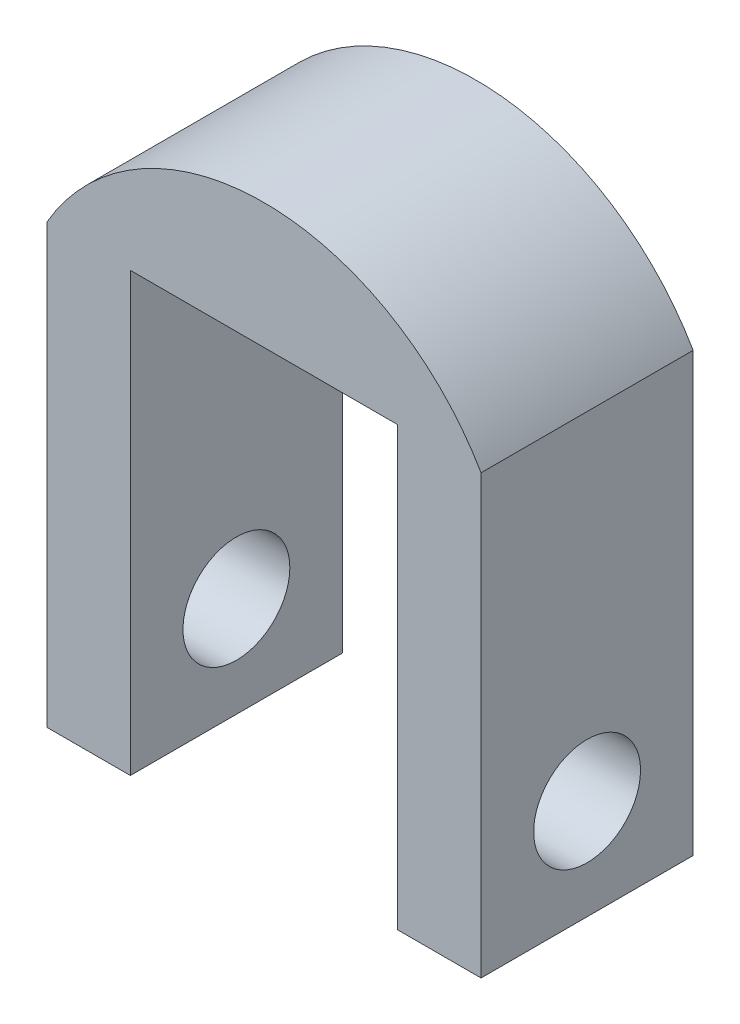
ISO-10303-21;
HEADER;
FILE_DESCRIPTION(('STEP AP214'),'2;1');
FILE_NAME('part.step','',(''),(''),'','','');
FILE_SCHEMA(('AUTOMOTIVE_DESIGN { 1 0 10303 214 1 1 1 1 }'));
ENDSEC;
DATA;
#1=APPLICATION_CONTEXT('core data for automotive mechanical design processes');
#2=APPLICATION_PROTOCOL_DEFINITION('international standard','automotive_design',2000,#1);
#3=PRODUCT_CONTEXT('',#1,'mechanical');
#4=PRODUCT('Part','Part','',(#3));
#5=PRODUCT_RELATED_PRODUCT_CATEGORY('part','',(#4));
#6=PRODUCT_DEFINITION_FORMATION('','',#4);
#7=PRODUCT_DEFINITION_CONTEXT('part definition',#1,'design');
#8=PRODUCT_DEFINITION('design','',#6,#7);
#9=PRODUCT_DEFINITION_SHAPE('','',#8);
#10=(LENGTH_UNIT() NAMED_UNIT(*) SI_UNIT(.MILLI.,.METRE.));
#11=(NAMED_UNIT(*) PLANE_ANGLE_UNIT() SI_UNIT($,.RADIAN.));
#12=(NAMED_UNIT(*) SI_UNIT($,.STERADIAN.) SOLID_ANGLE_UNIT());
#13=UNCERTAINTY_MEASURE_WITH_UNIT(LENGTH_MEASURE(1.E-05),#10,'distance_accuracy_value','');
#14=(GEOMETRIC_REPRESENTATION_CONTEXT(3) GLOBAL_UNCERTAINTY_ASSIGNED_CONTEXT((#13)) GLOBAL_UNIT_ASSIGNED_CONTEXT((#10,
#11,#12)) REPRESENTATION_CONTEXT('',''));
#15=CARTESIAN_POINT('',(0.,0.,0.));
#16=DIRECTION('',(0.,0.,1.));
#17=DIRECTION('',(1.,0.,0.));
#18=AXIS2_PLACEMENT_3D('',#15,#16,#17);
#19=CARTESIAN_POINT('',(-5.00000000000002,0.,12.7));
#20=DIRECTION('',(0.,1.,0.));
#21=DIRECTION('',(0.,0.,1.));
#22=AXIS2_PLACEMENT_3D('',#19,#20,#21);
#23=PLANE('',#22);
#24=DIRECTION('',(1.,0.,0.));
#25=VECTOR('',#24,1.);
#26=CARTESIAN_POINT('',(-5.00000000000002,0.,0.));
#27=LINE('',#26,#25);
#28=CARTESIAN_POINT('',(-5.00000000000002,0.,0.));
#29=VERTEX_POINT('',#28);
#30=CARTESIAN_POINT('',(0.,0.,0.));
#31=VERTEX_POINT('',#30);
#32=EDGE_CURVE('E128',#29,#31,#27,.T.);
#33=ORIENTED_EDGE('',*,*,#32,.T.);
#34=DIRECTION('',(0.,0.,-1.));
#35=VECTOR('',#34,1.);
#36=CARTESIAN_POINT('',(0.,0.,12.7));
#37=LINE('',#36,#35);
#38=CARTESIAN_POINT('',(0.,0.,12.7));
#39=VERTEX_POINT('',#38);
#40=EDGE_CURVE('E11',#39,#31,#37,.T.);
#41=ORIENTED_EDGE('',*,*,#40,.F.);
#42=DIRECTION('',(1.,0.,0.));
#43=VECTOR('',#42,1.);
#44=CARTESIAN_POINT('',(-5.00000000000002,0.,12.7));
#45=LINE('',#44,#43);
#46=CARTESIAN_POINT('',(-5.00000000000002,0.,12.7));
#47=VERTEX_POINT('',#46);
#48=EDGE_CURVE('E143',#47,#39,#45,.T.);
#49=ORIENTED_EDGE('',*,*,#48,.F.);
#50=DIRECTION('',(0.,0.,-1.));
#51=VECTOR('',#50,1.);
#52=CARTESIAN_POINT('',(-5.00000000000002,0.,12.7));
#53=LINE('',#52,#51);
#54=EDGE_CURVE('E124',#47,#29,#53,.T.);
#55=ORIENTED_EDGE('',*,*,#54,.T.);
#56=EDGE_LOOP('',(#33,#41,#49,#55));
#57=FACE_BOUND('',#56,.T.);
#58=ADVANCED_FACE('F31',(#57),#23,.F.);
#59=CARTESIAN_POINT('',(0.,0.,12.7));
#60=DIRECTION('',(-1.,0.,0.));
#61=DIRECTION('',(0.,-1.,0.));
#62=AXIS2_PLACEMENT_3D('',#59,#60,#61);
#63=PLANE('',#62);
#64=CARTESIAN_POINT('',(0.,6.,6.35));
#65=DIRECTION('',(1.,0.,0.));
#66=DIRECTION('',(0.,0.,-1.));
#67=AXIS2_PLACEMENT_3D('',#64,#65,#66);
#68=CIRCLE('',#67,3.2);
#69=CARTESIAN_POINT('',(0.,6.,3.15));
#70=VERTEX_POINT('',#69);
#71=EDGE_CURVE('E179',#70,#70,#68,.T.);
#72=ORIENTED_EDGE('',*,*,#71,.F.);
#73=EDGE_LOOP('',(#72));
#74=FACE_BOUND('',#73,.T.);
#75=DIRECTION('',(0.,1.,0.));
#76=VECTOR('',#75,1.);
#77=CARTESIAN_POINT('',(0.,0.,0.));
#78=LINE('',#77,#76);
#79=CARTESIAN_POINT('',(0.,26.2,0.));
#80=VERTEX_POINT('',#79);
#81=EDGE_CURVE('E131',#31,#80,#78,.T.);
#82=ORIENTED_EDGE('',*,*,#81,.T.);
#83=DIRECTION('',(0.,0.,-1.));
#84=VECTOR('',#83,1.);
#85=CARTESIAN_POINT('',(0.,26.2,12.7));
#86=LINE('',#85,#84);
#87=CARTESIAN_POINT('',(0.,26.2,12.7));
#88=VERTEX_POINT('',#87);
#89=EDGE_CURVE('E40',#88,#80,#86,.T.);
#90=ORIENTED_EDGE('',*,*,#89,.F.);
#91=DIRECTION('',(0.,1.,0.));
#92=VECTOR('',#91,1.);
#93=CARTESIAN_POINT('',(0.,0.,12.7));
#94=LINE('',#93,#92);
#95=EDGE_CURVE('E91',#39,#88,#94,.T.);
#96=ORIENTED_EDGE('',*,*,#95,.F.);
#97=ORIENTED_EDGE('',*,*,#40,.T.);
#98=EDGE_LOOP('',(#82,#90,#96,#97));
#99=FACE_BOUND('',#98,.T.);
#100=ADVANCED_FACE('F204',(#74,#99),#63,.F.);
#101=CARTESIAN_POINT('',(-13.,18.7166852264521,12.7));
#102=DIRECTION('',(0.,0.,-1.));
#103=DIRECTION('',(-1.,0.,0.));
#104=AXIS2_PLACEMENT_3D('',#101,#102,#103);
#105=CYLINDRICAL_SURFACE('',#104,15.);
#106=CARTESIAN_POINT('',(-13.,18.7166852264521,0.));
#107=DIRECTION('',(0.,0.,1.));
#108=DIRECTION('',(1.,0.,0.));
#109=AXIS2_PLACEMENT_3D('',#106,#107,#108);
#110=CIRCLE('',#109,15.);
#111=CARTESIAN_POINT('',(-26.,26.2,0.));
#112=VERTEX_POINT('',#111);
#113=EDGE_CURVE('E134',#80,#112,#110,.T.);
#114=ORIENTED_EDGE('',*,*,#113,.T.);
#115=DIRECTION('',(0.,0.,-1.));
#116=VECTOR('',#115,1.);
#117=CARTESIAN_POINT('',(-26.,26.2,12.7));
#118=LINE('',#117,#116);
#119=CARTESIAN_POINT('',(-26.,26.2,12.7));
#120=VERTEX_POINT('',#119);
#121=EDGE_CURVE('E150',#120,#112,#118,.T.);
#122=ORIENTED_EDGE('',*,*,#121,.F.);
#123=CARTESIAN_POINT('',(-13.,18.7166852264521,12.7));
#124=DIRECTION('',(0.,0.,1.));
#125=DIRECTION('',(1.,0.,0.));
#126=AXIS2_PLACEMENT_3D('',#123,#124,#125);
#127=CIRCLE('',#126,15.);
#128=EDGE_CURVE('E159',#88,#120,#127,.T.);
#129=ORIENTED_EDGE('',*,*,#128,.F.);
#130=ORIENTED_EDGE('',*,*,#89,.T.);
#131=EDGE_LOOP('',(#114,#122,#129,#130));
#132=FACE_BOUND('',#131,.T.);
#133=ADVANCED_FACE('F157',(#132),#105,.T.);
#134=CARTESIAN_POINT('',(-26.,26.2,12.7));
#135=DIRECTION('',(1.,0.,0.));
#136=DIRECTION('',(0.,1.,0.));
#137=AXIS2_PLACEMENT_3D('',#134,#135,#136);
#138=PLANE('',#137);
#139=CARTESIAN_POINT('',(-26.,6.,6.35));
#140=DIRECTION('',(1.,0.,0.));
#141=DIRECTION('',(0.,0.,-1.));
#142=AXIS2_PLACEMENT_3D('',#139,#140,#141);
#143=CIRCLE('',#142,3.2);
#144=CARTESIAN_POINT('',(-26.,6.,3.15));
#145=VERTEX_POINT('',#144);
#146=EDGE_CURVE('E182',#145,#145,#143,.T.);
#147=ORIENTED_EDGE('',*,*,#146,.T.);
#148=EDGE_LOOP('',(#147));
#149=FACE_BOUND('',#148,.T.);
#150=DIRECTION('',(0.,-1.,0.));
#151=VECTOR('',#150,1.);
#152=CARTESIAN_POINT('',(-26.,26.2,0.));
#153=LINE('',#152,#151);
#154=CARTESIAN_POINT('',(-26.,0.,0.));
#155=VERTEX_POINT('',#154);
#156=EDGE_CURVE('E136',#112,#155,#153,.T.);
#157=ORIENTED_EDGE('',*,*,#156,.T.);
#158=DIRECTION('',(0.,0.,-1.));
#159=VECTOR('',#158,1.);
#160=CARTESIAN_POINT('',(-26.,0.,12.7));
#161=LINE('',#160,#159);
#162=CARTESIAN_POINT('',(-26.,0.,12.7));
#163=VERTEX_POINT('',#162);
#164=EDGE_CURVE('E147',#163,#155,#161,.T.);
#165=ORIENTED_EDGE('',*,*,#164,.F.);
#166=DIRECTION('',(0.,-1.,0.));
#167=VECTOR('',#166,1.);
#168=CARTESIAN_POINT('',(-26.,26.2,12.7));
#169=LINE('',#168,#167);
#170=EDGE_CURVE('E171',#120,#163,#169,.T.);
#171=ORIENTED_EDGE('',*,*,#170,.F.);
#172=ORIENTED_EDGE('',*,*,#121,.T.);
#173=EDGE_LOOP('',(#157,#165,#171,#172));
#174=FACE_BOUND('',#173,.T.);
#175=ADVANCED_FACE('F167',(#149,#174),#138,.F.);
#176=CARTESIAN_POINT('',(-26.,0.,12.7));
#177=DIRECTION('',(0.,1.,0.));
#178=DIRECTION('',(0.,0.,1.));
#179=AXIS2_PLACEMENT_3D('',#176,#177,#178);
#180=PLANE('',#179);
#181=DIRECTION('',(1.,0.,0.));
#182=VECTOR('',#181,1.);
#183=CARTESIAN_POINT('',(-26.,0.,0.));
#184=LINE('',#183,#182);
#185=CARTESIAN_POINT('',(-21.,0.,0.));
#186=VERTEX_POINT('',#185);
#187=EDGE_CURVE('E138',#155,#186,#184,.T.);
#188=ORIENTED_EDGE('',*,*,#187,.T.);
#189=DIRECTION('',(0.,0.,-1.));
#190=VECTOR('',#189,1.);
#191=CARTESIAN_POINT('',(-21.,0.,12.7));
#192=LINE('',#191,#190);
#193=CARTESIAN_POINT('',(-21.,0.,12.7));
#194=VERTEX_POINT('',#193);
#195=EDGE_CURVE('E119',#194,#186,#192,.T.);
#196=ORIENTED_EDGE('',*,*,#195,.F.);
#197=DIRECTION('',(1.,0.,0.));
#198=VECTOR('',#197,1.);
#199=CARTESIAN_POINT('',(-26.,0.,12.7));
#200=LINE('',#199,#198);
#201=EDGE_CURVE('E110',#163,#194,#200,.T.);
#202=ORIENTED_EDGE('',*,*,#201,.F.);
#203=ORIENTED_EDGE('',*,*,#164,.T.);
#204=EDGE_LOOP('',(#188,#196,#202,#203));
#205=FACE_BOUND('',#204,.T.);
#206=ADVANCED_FACE('F170',(#205),#180,.F.);
#207=CARTESIAN_POINT('',(-21.,0.,12.7));
#208=DIRECTION('',(-1.,0.,0.));
#209=DIRECTION('',(0.,-1.,0.));
#210=AXIS2_PLACEMENT_3D('',#207,#208,#209);
#211=PLANE('',#210);
#212=CARTESIAN_POINT('',(-21.,6.,6.35));
#213=DIRECTION('',(-1.,0.,0.));
#214=DIRECTION('',(0.,-1.,0.));
#215=AXIS2_PLACEMENT_3D('',#212,#213,#214);
#216=CIRCLE('',#215,3.2);
#217=CARTESIAN_POINT('',(-21.,2.8,6.35));
#218=VERTEX_POINT('',#217);
#219=EDGE_CURVE('E132',#218,#218,#216,.T.);
#220=ORIENTED_EDGE('',*,*,#219,.T.);
#221=EDGE_LOOP('',(#220));
#222=FACE_BOUND('',#221,.T.);
#223=DIRECTION('',(0.,1.,0.));
#224=VECTOR('',#223,1.);
#225=CARTESIAN_POINT('',(-21.,0.,0.));
#226=LINE('',#225,#224);
#227=CARTESIAN_POINT('',(-21.,26.2,0.));
#228=VERTEX_POINT('',#227);
#229=EDGE_CURVE('E118',#186,#228,#226,.T.);
#230=ORIENTED_EDGE('',*,*,#229,.T.);
#231=DIRECTION('',(0.,0.,-1.));
#232=VECTOR('',#231,1.);
#233=CARTESIAN_POINT('',(-21.,26.2,12.7));
#234=LINE('',#233,#232);
#235=CARTESIAN_POINT('',(-21.,26.2,12.7));
#236=VERTEX_POINT('',#235);
#237=EDGE_CURVE('E115',#236,#228,#234,.T.);
#238=ORIENTED_EDGE('',*,*,#237,.F.);
#239=DIRECTION('',(0.,1.,0.));
#240=VECTOR('',#239,1.);
#241=CARTESIAN_POINT('',(-21.,0.,12.7));
#242=LINE('',#241,#240);
#243=EDGE_CURVE('E104',#194,#236,#242,.T.);
#244=ORIENTED_EDGE('',*,*,#243,.F.);
#245=ORIENTED_EDGE('',*,*,#195,.T.);
#246=EDGE_LOOP('',(#230,#238,#244,#245));
#247=FACE_BOUND('',#246,.T.);
#248=ADVANCED_FACE('F116',(#222,#247),#211,.F.);
#249=CARTESIAN_POINT('',(-21.,26.2,12.7));
#250=DIRECTION('',(0.,1.,0.));
#251=DIRECTION('',(0.,0.,1.));
#252=AXIS2_PLACEMENT_3D('',#249,#250,#251);
#253=PLANE('',#252);
#254=DIRECTION('',(1.,0.,0.));
#255=VECTOR('',#254,1.);
#256=CARTESIAN_POINT('',(-21.,26.2,0.));
#257=LINE('',#256,#255);
#258=CARTESIAN_POINT('',(-5.00000000000002,26.2,0.));
#259=VERTEX_POINT('',#258);
#260=EDGE_CURVE('E77',#228,#259,#257,.T.);
#261=ORIENTED_EDGE('',*,*,#260,.T.);
#262=DIRECTION('',(0.,0.,-1.));
#263=VECTOR('',#262,1.);
#264=CARTESIAN_POINT('',(-5.00000000000002,26.2,12.7));
#265=LINE('',#264,#263);
#266=CARTESIAN_POINT('',(-5.00000000000002,26.2,12.7));
#267=VERTEX_POINT('',#266);
#268=EDGE_CURVE('E120',#267,#259,#265,.T.);
#269=ORIENTED_EDGE('',*,*,#268,.F.);
#270=DIRECTION('',(1.,0.,0.));
#271=VECTOR('',#270,1.);
#272=CARTESIAN_POINT('',(-21.,26.2,12.7));
#273=LINE('',#272,#271);
#274=EDGE_CURVE('E108',#236,#267,#273,.T.);
#275=ORIENTED_EDGE('',*,*,#274,.F.);
#276=ORIENTED_EDGE('',*,*,#237,.T.);
#277=EDGE_LOOP('',(#261,#269,#275,#276));
#278=FACE_BOUND('',#277,.T.);
#279=ADVANCED_FACE('F122',(#278),#253,.F.);
#280=CARTESIAN_POINT('',(-5.00000000000002,26.2,12.7));
#281=DIRECTION('',(1.,0.,0.));
#282=DIRECTION('',(0.,1.,0.));
#283=AXIS2_PLACEMENT_3D('',#280,#281,#282);
#284=PLANE('',#283);
#285=CARTESIAN_POINT('',(-5.00000000000002,6.,6.35));
#286=DIRECTION('',(1.,0.,0.));
#287=DIRECTION('',(0.,1.,0.));
#288=AXIS2_PLACEMENT_3D('',#285,#286,#287);
#289=CIRCLE('',#288,3.2);
#290=CARTESIAN_POINT('',(-5.00000000000002,9.2,6.35));
#291=VERTEX_POINT('',#290);
#292=EDGE_CURVE('E34',#291,#291,#289,.T.);
#293=ORIENTED_EDGE('',*,*,#292,.T.);
#294=EDGE_LOOP('',(#293));
#295=FACE_BOUND('',#294,.T.);
#296=DIRECTION('',(0.,-1.,0.));
#297=VECTOR('',#296,1.);
#298=CARTESIAN_POINT('',(-5.00000000000002,26.2,0.));
#299=LINE('',#298,#297);
#300=EDGE_CURVE('E83',#259,#29,#299,.T.);
#301=ORIENTED_EDGE('',*,*,#300,.T.);
#302=ORIENTED_EDGE('',*,*,#54,.F.);
#303=DIRECTION('',(0.,-1.,0.));
#304=VECTOR('',#303,1.);
#305=CARTESIAN_POINT('',(-5.00000000000002,26.2,12.7));
#306=LINE('',#305,#304);
#307=EDGE_CURVE('E48',#267,#47,#306,.T.);
#308=ORIENTED_EDGE('',*,*,#307,.F.);
#309=ORIENTED_EDGE('',*,*,#268,.T.);
#310=EDGE_LOOP('',(#301,#302,#308,#309));
#311=FACE_BOUND('',#310,.T.);
#312=ADVANCED_FACE('F189',(#295,#311),#284,.F.);
#313=CARTESIAN_POINT('',(-13.,18.7166852264521,12.7));
#314=DIRECTION('',(0.,0.,1.));
#315=DIRECTION('',(1.,0.,0.));
#316=AXIS2_PLACEMENT_3D('',#313,#314,#315);
#317=PLANE('',#316);
#318=ORIENTED_EDGE('',*,*,#48,.T.);
#319=ORIENTED_EDGE('',*,*,#95,.T.);
#320=ORIENTED_EDGE('',*,*,#128,.T.);
#321=ORIENTED_EDGE('',*,*,#170,.T.);
#322=ORIENTED_EDGE('',*,*,#201,.T.);
#323=ORIENTED_EDGE('',*,*,#243,.T.);
#324=ORIENTED_EDGE('',*,*,#274,.T.);
#325=ORIENTED_EDGE('',*,*,#307,.T.);
#326=EDGE_LOOP('',(#318,#319,#320,#321,#322,#323,#324,#325));
#327=FACE_BOUND('',#326,.T.);
#328=ADVANCED_FACE('F106',(#327),#317,.T.);
#329=CARTESIAN_POINT('',(-13.,18.7166852264521,0.));
#330=DIRECTION('',(0.,0.,1.));
#331=DIRECTION('',(1.,0.,0.));
#332=AXIS2_PLACEMENT_3D('',#329,#330,#331);
#333=PLANE('',#332);
#334=ORIENTED_EDGE('',*,*,#32,.F.);
#335=ORIENTED_EDGE('',*,*,#300,.F.);
#336=ORIENTED_EDGE('',*,*,#260,.F.);
#337=ORIENTED_EDGE('',*,*,#229,.F.);
#338=ORIENTED_EDGE('',*,*,#187,.F.);
#339=ORIENTED_EDGE('',*,*,#156,.F.);
#340=ORIENTED_EDGE('',*,*,#113,.F.);
#341=ORIENTED_EDGE('',*,*,#81,.F.);
#342=EDGE_LOOP('',(#334,#335,#336,#337,#338,#339,#340,#341));
#343=FACE_BOUND('',#342,.T.);
#344=ADVANCED_FACE('F163',(#343),#333,.F.);
#345=CARTESIAN_POINT('',(-26.,6.,6.35));
#346=DIRECTION('',(1.,0.,0.));
#347=DIRECTION('',(0.,0.,-1.));
#348=AXIS2_PLACEMENT_3D('',#345,#346,#347);
#349=CYLINDRICAL_SURFACE('',#348,3.2);
#350=ORIENTED_EDGE('',*,*,#71,.T.);
#351=EDGE_LOOP('',(#350));
#352=FACE_BOUND('',#351,.T.);
#353=ORIENTED_EDGE('',*,*,#292,.F.);
#354=EDGE_LOOP('',(#353));
#355=FACE_BOUND('',#354,.T.);
#356=ADVANCED_FACE('F191',(#352,#355),#349,.F.);
#357=ORIENTED_EDGE('',*,*,#146,.F.);
#358=EDGE_LOOP('',(#357));
#359=FACE_BOUND('',#358,.T.);
#360=ORIENTED_EDGE('',*,*,#219,.F.);
#361=EDGE_LOOP('',(#360));
#362=FACE_BOUND('',#361,.T.);
#363=ADVANCED_FACE('F193',(#359,#362),#349,.F.);
#364=CLOSED_SHELL('',(#58,#100,#133,#175,#206,#248,#279,#312,#328,#344,#356,#363));
#365=MANIFOLD_SOLID_BREP('B2',#364);
#366=ADVANCED_BREP_SHAPE_REPRESENTATION('',(#18,#365),#14);
#367=SHAPE_DEFINITION_REPRESENTATION(#9,#366);
ENDSEC;
END-ISO-10303-21;
